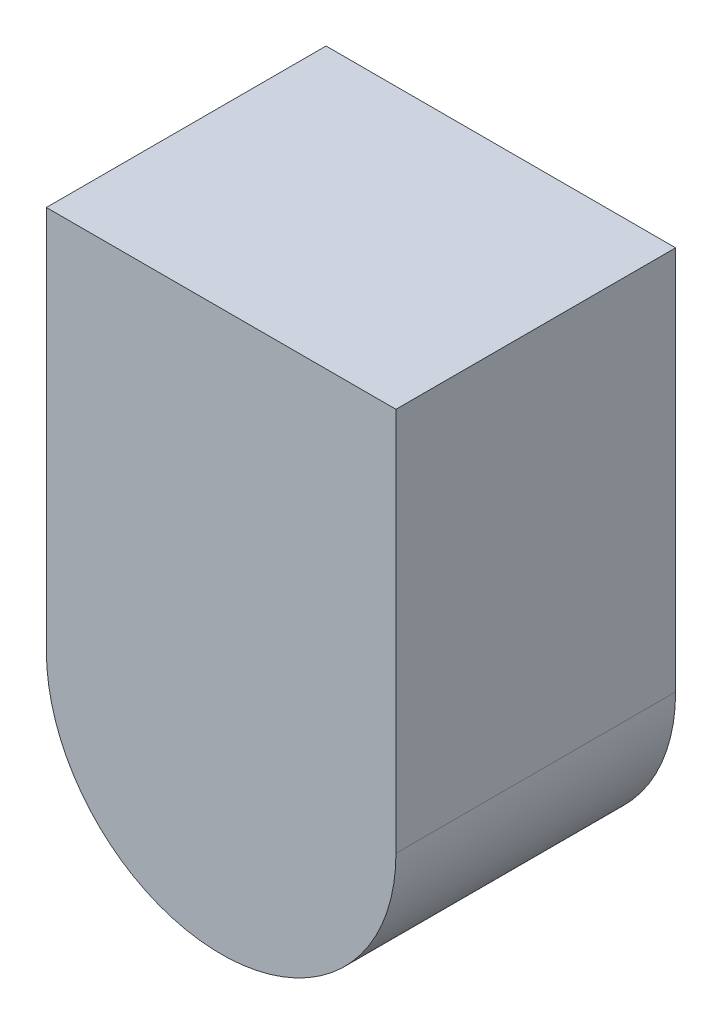
ISO-10303-21;
HEADER;
FILE_DESCRIPTION(('STEP AP214'),'2;1');
FILE_NAME('part.step','',(''),(''),'','','');
FILE_SCHEMA(('AUTOMOTIVE_DESIGN { 1 0 10303 214 1 1 1 1 }'));
ENDSEC;
DATA;
#1=APPLICATION_CONTEXT('core data for automotive mechanical design processes');
#2=APPLICATION_PROTOCOL_DEFINITION('international standard','automotive_design',2000,#1);
#3=PRODUCT_CONTEXT('',#1,'mechanical');
#4=PRODUCT('Part','Part','',(#3));
#5=PRODUCT_RELATED_PRODUCT_CATEGORY('part','',(#4));
#6=PRODUCT_DEFINITION_FORMATION('','',#4);
#7=PRODUCT_DEFINITION_CONTEXT('part definition',#1,'design');
#8=PRODUCT_DEFINITION('design','',#6,#7);
#9=PRODUCT_DEFINITION_SHAPE('','',#8);
#10=(LENGTH_UNIT() NAMED_UNIT(*) SI_UNIT(.MILLI.,.METRE.));
#11=(NAMED_UNIT(*) PLANE_ANGLE_UNIT() SI_UNIT($,.RADIAN.));
#12=(NAMED_UNIT(*) SI_UNIT($,.STERADIAN.) SOLID_ANGLE_UNIT());
#13=UNCERTAINTY_MEASURE_WITH_UNIT(LENGTH_MEASURE(1.E-05),#10,'distance_accuracy_value','');
#14=(GEOMETRIC_REPRESENTATION_CONTEXT(3) GLOBAL_UNCERTAINTY_ASSIGNED_CONTEXT((#13)) GLOBAL_UNIT_ASSIGNED_CONTEXT((#10,
#11,#12)) REPRESENTATION_CONTEXT('',''));
#15=CARTESIAN_POINT('',(0.,0.,0.));
#16=DIRECTION('',(0.,0.,1.));
#17=DIRECTION('',(1.,0.,0.));
#18=AXIS2_PLACEMENT_3D('',#15,#16,#17);
#19=CARTESIAN_POINT('',(0.499999999999998,0.725,0.));
#20=DIRECTION('',(0.,0.,1.));
#21=DIRECTION('',(-1.,0.,0.));
#22=AXIS2_PLACEMENT_3D('',#19,#20,#21);
#23=CYLINDRICAL_SURFACE('',#22,0.125);
#24=CARTESIAN_POINT('',(0.499999999999998,0.725,0.));
#25=DIRECTION('',(0.,0.,1.));
#26=DIRECTION('',(-1.,0.,0.));
#27=AXIS2_PLACEMENT_3D('',#24,#25,#26);
#28=CIRCLE('',#27,0.125);
#29=CARTESIAN_POINT('',(0.374999999999998,0.724999999999999,0.));
#30=VERTEX_POINT('',#29);
#31=CARTESIAN_POINT('',(0.624999999999997,0.725,0.));
#32=VERTEX_POINT('',#31);
#33=EDGE_CURVE('E11',#30,#32,#28,.T.);
#34=ORIENTED_EDGE('',*,*,#33,.T.);
#35=DIRECTION('',(0.,0.,1.));
#36=VECTOR('',#35,1.);
#37=CARTESIAN_POINT('',(0.624999999999997,0.725,0.));
#38=LINE('',#37,#36);
#39=CARTESIAN_POINT('',(0.624999999999997,0.725,0.2));
#40=VERTEX_POINT('',#39);
#41=EDGE_CURVE('E24',#32,#40,#38,.T.);
#42=ORIENTED_EDGE('',*,*,#41,.T.);
#43=CARTESIAN_POINT('',(0.499999999999998,0.725,0.2));
#44=DIRECTION('',(0.,0.,1.));
#45=DIRECTION('',(-1.,0.,0.));
#46=AXIS2_PLACEMENT_3D('',#43,#44,#45);
#47=CIRCLE('',#46,0.125);
#48=CARTESIAN_POINT('',(0.374999999999998,0.724999999999999,0.2));
#49=VERTEX_POINT('',#48);
#50=EDGE_CURVE('E75',#49,#40,#47,.T.);
#51=ORIENTED_EDGE('',*,*,#50,.F.);
#52=DIRECTION('',(0.,0.,1.));
#53=VECTOR('',#52,1.);
#54=CARTESIAN_POINT('',(0.374999999999998,0.724999999999999,0.));
#55=LINE('',#54,#53);
#56=EDGE_CURVE('E86',#30,#49,#55,.T.);
#57=ORIENTED_EDGE('',*,*,#56,.F.);
#58=EDGE_LOOP('',(#34,#42,#51,#57));
#59=FACE_BOUND('',#58,.T.);
#60=ADVANCED_FACE('F17',(#59),#23,.T.);
#61=CARTESIAN_POINT('',(0.374999999999996,1.,0.));
#62=DIRECTION('',(-1.,0.,0.));
#63=DIRECTION('',(0.,-1.,0.));
#64=AXIS2_PLACEMENT_3D('',#61,#62,#63);
#65=PLANE('',#64);
#66=DIRECTION('',(0.,-1.,0.));
#67=VECTOR('',#66,1.);
#68=CARTESIAN_POINT('',(0.374999999999996,1.,0.));
#69=LINE('',#68,#67);
#70=CARTESIAN_POINT('',(0.374999999999996,1.,0.));
#71=VERTEX_POINT('',#70);
#72=EDGE_CURVE('E83',#71,#30,#69,.T.);
#73=ORIENTED_EDGE('',*,*,#72,.T.);
#74=ORIENTED_EDGE('',*,*,#56,.T.);
#75=DIRECTION('',(0.,-1.,0.));
#76=VECTOR('',#75,1.);
#77=CARTESIAN_POINT('',(0.374999999999996,1.,0.2));
#78=LINE('',#77,#76);
#79=CARTESIAN_POINT('',(0.374999999999996,1.,0.2));
#80=VERTEX_POINT('',#79);
#81=EDGE_CURVE('E81',#80,#49,#78,.T.);
#82=ORIENTED_EDGE('',*,*,#81,.F.);
#83=DIRECTION('',(0.,0.,1.));
#84=VECTOR('',#83,1.);
#85=CARTESIAN_POINT('',(0.374999999999996,1.,0.));
#86=LINE('',#85,#84);
#87=EDGE_CURVE('E61',#71,#80,#86,.T.);
#88=ORIENTED_EDGE('',*,*,#87,.F.);
#89=EDGE_LOOP('',(#73,#74,#82,#88));
#90=FACE_BOUND('',#89,.T.);
#91=ADVANCED_FACE('F91',(#90),#65,.T.);
#92=CARTESIAN_POINT('',(0.624999999999996,1.,0.));
#93=DIRECTION('',(0.,1.,0.));
#94=DIRECTION('',(-1.,0.,0.));
#95=AXIS2_PLACEMENT_3D('',#92,#93,#94);
#96=PLANE('',#95);
#97=DIRECTION('',(-1.,0.,0.));
#98=VECTOR('',#97,1.);
#99=CARTESIAN_POINT('',(0.624999999999996,1.,0.));
#100=LINE('',#99,#98);
#101=CARTESIAN_POINT('',(0.624999999999996,1.,0.));
#102=VERTEX_POINT('',#101);
#103=EDGE_CURVE('E65',#102,#71,#100,.T.);
#104=ORIENTED_EDGE('',*,*,#103,.T.);
#105=ORIENTED_EDGE('',*,*,#87,.T.);
#106=DIRECTION('',(-1.,0.,0.));
#107=VECTOR('',#106,1.);
#108=CARTESIAN_POINT('',(0.624999999999996,1.,0.2));
#109=LINE('',#108,#107);
#110=CARTESIAN_POINT('',(0.624999999999996,1.,0.2));
#111=VERTEX_POINT('',#110);
#112=EDGE_CURVE('E54',#111,#80,#109,.T.);
#113=ORIENTED_EDGE('',*,*,#112,.F.);
#114=DIRECTION('',(0.,0.,1.));
#115=VECTOR('',#114,1.);
#116=CARTESIAN_POINT('',(0.624999999999996,1.,0.));
#117=LINE('',#116,#115);
#118=EDGE_CURVE('E58',#102,#111,#117,.T.);
#119=ORIENTED_EDGE('',*,*,#118,.F.);
#120=EDGE_LOOP('',(#104,#105,#113,#119));
#121=FACE_BOUND('',#120,.T.);
#122=ADVANCED_FACE('F57',(#121),#96,.T.);
#123=CARTESIAN_POINT('',(0.624999999999997,0.725,0.));
#124=DIRECTION('',(1.,0.,0.));
#125=DIRECTION('',(0.,1.,0.));
#126=AXIS2_PLACEMENT_3D('',#123,#124,#125);
#127=PLANE('',#126);
#128=DIRECTION('',(0.,1.,0.));
#129=VECTOR('',#128,1.);
#130=CARTESIAN_POINT('',(0.624999999999997,0.725,0.));
#131=LINE('',#130,#129);
#132=EDGE_CURVE('E71',#32,#102,#131,.T.);
#133=ORIENTED_EDGE('',*,*,#132,.T.);
#134=ORIENTED_EDGE('',*,*,#118,.T.);
#135=DIRECTION('',(0.,1.,0.));
#136=VECTOR('',#135,1.);
#137=CARTESIAN_POINT('',(0.624999999999997,0.725,0.2));
#138=LINE('',#137,#136);
#139=EDGE_CURVE('E70',#40,#111,#138,.T.);
#140=ORIENTED_EDGE('',*,*,#139,.F.);
#141=ORIENTED_EDGE('',*,*,#41,.F.);
#142=EDGE_LOOP('',(#133,#134,#140,#141));
#143=FACE_BOUND('',#142,.T.);
#144=ADVANCED_FACE('F69',(#143),#127,.T.);
#145=CARTESIAN_POINT('',(0.499999999999997,0.8,0.2));
#146=DIRECTION('',(0.,0.,1.));
#147=DIRECTION('',(1.,0.,0.));
#148=AXIS2_PLACEMENT_3D('',#145,#146,#147);
#149=PLANE('',#148);
#150=ORIENTED_EDGE('',*,*,#139,.T.);
#151=ORIENTED_EDGE('',*,*,#112,.T.);
#152=ORIENTED_EDGE('',*,*,#81,.T.);
#153=ORIENTED_EDGE('',*,*,#50,.T.);
#154=EDGE_LOOP('',(#150,#151,#152,#153));
#155=FACE_BOUND('',#154,.T.);
#156=ADVANCED_FACE('F74',(#155),#149,.T.);
#157=CARTESIAN_POINT('',(0.499999999999997,0.8,0.));
#158=DIRECTION('',(0.,0.,1.));
#159=DIRECTION('',(1.,0.,0.));
#160=AXIS2_PLACEMENT_3D('',#157,#158,#159);
#161=PLANE('',#160);
#162=ORIENTED_EDGE('',*,*,#132,.F.);
#163=ORIENTED_EDGE('',*,*,#33,.F.);
#164=ORIENTED_EDGE('',*,*,#72,.F.);
#165=ORIENTED_EDGE('',*,*,#103,.F.);
#166=EDGE_LOOP('',(#162,#163,#164,#165));
#167=FACE_BOUND('',#166,.T.);
#168=ADVANCED_FACE('F89',(#167),#161,.F.);
#169=CLOSED_SHELL('',(#60,#91,#122,#144,#156,#168));
#170=MANIFOLD_SOLID_BREP('B1',#169);
#171=ADVANCED_BREP_SHAPE_REPRESENTATION('',(#18,#170),#14);
#172=SHAPE_DEFINITION_REPRESENTATION(#9,#171);
ENDSEC;
END-ISO-10303-21;
